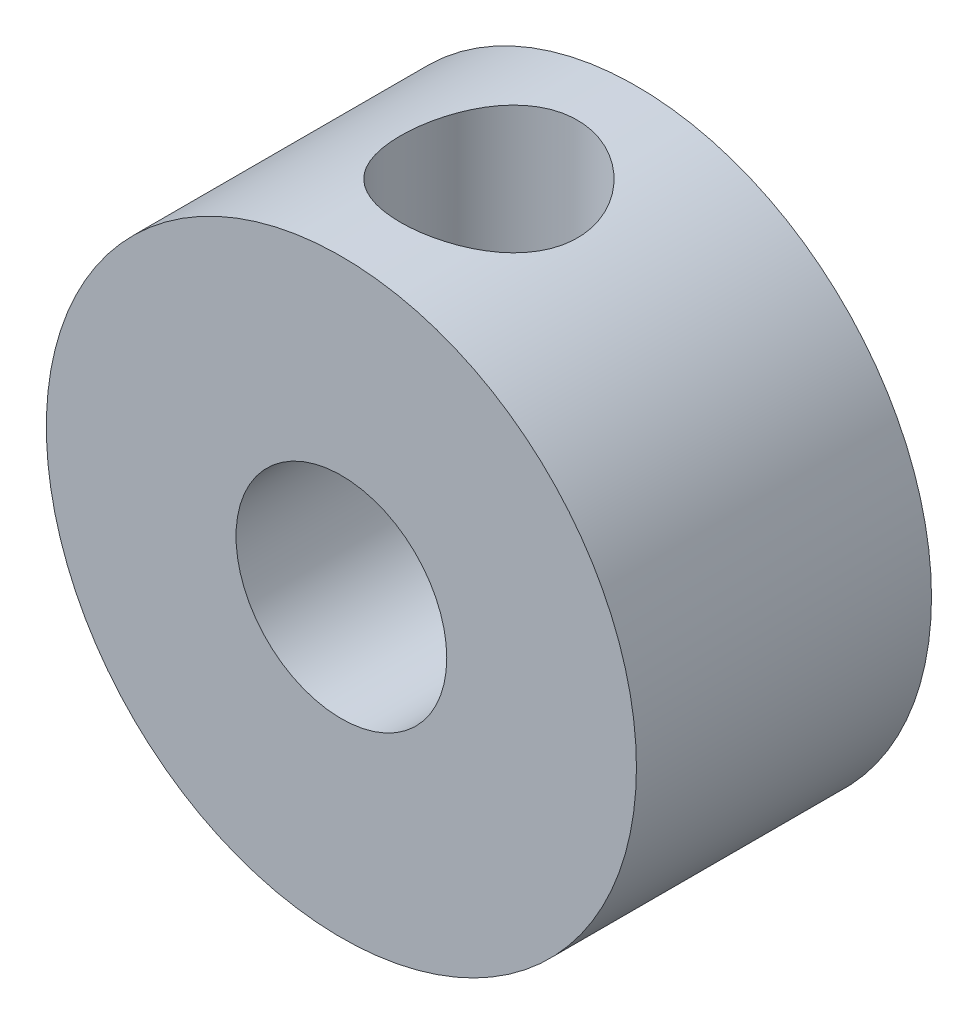
ISO-10303-21;
HEADER;
FILE_DESCRIPTION(('STEP AP214'),'2;1');
FILE_NAME('part.step','',(''),(''),'','','');
FILE_SCHEMA(('AUTOMOTIVE_DESIGN { 1 0 10303 214 1 1 1 1 }'));
ENDSEC;
DATA;
#1=APPLICATION_CONTEXT('core data for automotive mechanical design processes');
#2=APPLICATION_PROTOCOL_DEFINITION('international standard','automotive_design',2000,#1);
#3=PRODUCT_CONTEXT('',#1,'mechanical');
#4=PRODUCT('Part','Part','',(#3));
#5=PRODUCT_RELATED_PRODUCT_CATEGORY('part','',(#4));
#6=PRODUCT_DEFINITION_FORMATION('','',#4);
#7=PRODUCT_DEFINITION_CONTEXT('part definition',#1,'design');
#8=PRODUCT_DEFINITION('design','',#6,#7);
#9=PRODUCT_DEFINITION_SHAPE('','',#8);
#10=(LENGTH_UNIT() NAMED_UNIT(*) SI_UNIT(.MILLI.,.METRE.));
#11=(NAMED_UNIT(*) PLANE_ANGLE_UNIT() SI_UNIT($,.RADIAN.));
#12=(NAMED_UNIT(*) SI_UNIT($,.STERADIAN.) SOLID_ANGLE_UNIT());
#13=UNCERTAINTY_MEASURE_WITH_UNIT(LENGTH_MEASURE(1.E-05),#10,'distance_accuracy_value','');
#14=(GEOMETRIC_REPRESENTATION_CONTEXT(3) GLOBAL_UNCERTAINTY_ASSIGNED_CONTEXT((#13)) GLOBAL_UNIT_ASSIGNED_CONTEXT((#10,
#11,#12)) REPRESENTATION_CONTEXT('',''));
#15=CARTESIAN_POINT('',(0.,0.,0.));
#16=DIRECTION('',(0.,0.,1.));
#17=DIRECTION('',(1.,0.,0.));
#18=AXIS2_PLACEMENT_3D('',#15,#16,#17);
#19=CARTESIAN_POINT('',(0.,0.,7.));
#20=DIRECTION('',(0.,0.,1.));
#21=DIRECTION('',(1.,0.,0.));
#22=AXIS2_PLACEMENT_3D('',#19,#20,#21);
#23=PLANE('',#22);
#24=CARTESIAN_POINT('',(0.,0.,7.));
#25=DIRECTION('',(0.,0.,1.));
#26=DIRECTION('',(1.,0.,0.));
#27=AXIS2_PLACEMENT_3D('',#24,#25,#26);
#28=CIRCLE('',#27,7.);
#29=CARTESIAN_POINT('',(7.,0.,7.));
#30=VERTEX_POINT('',#29);
#31=EDGE_CURVE('E10',#30,#30,#28,.T.);
#32=ORIENTED_EDGE('',*,*,#31,.T.);
#33=EDGE_LOOP('',(#32));
#34=FACE_BOUND('',#33,.T.);
#35=CARTESIAN_POINT('',(0.,0.,7.));
#36=DIRECTION('',(0.,0.,1.));
#37=DIRECTION('',(1.,0.,0.));
#38=AXIS2_PLACEMENT_3D('',#35,#36,#37);
#39=CIRCLE('',#38,2.5);
#40=CARTESIAN_POINT('',(2.5,0.,7.));
#41=VERTEX_POINT('',#40);
#42=EDGE_CURVE('E47',#41,#41,#39,.T.);
#43=ORIENTED_EDGE('',*,*,#42,.F.);
#44=EDGE_LOOP('',(#43));
#45=FACE_BOUND('',#44,.T.);
#46=ADVANCED_FACE('F35',(#34,#45),#23,.T.);
#47=CARTESIAN_POINT('',(0.,0.,0.));
#48=DIRECTION('',(0.,0.,1.));
#49=DIRECTION('',(1.,0.,0.));
#50=AXIS2_PLACEMENT_3D('',#47,#48,#49);
#51=PLANE('',#50);
#52=CARTESIAN_POINT('',(0.,0.,0.));
#53=DIRECTION('',(0.,0.,1.));
#54=DIRECTION('',(1.,0.,0.));
#55=AXIS2_PLACEMENT_3D('',#52,#53,#54);
#56=CIRCLE('',#55,7.);
#57=CARTESIAN_POINT('',(7.,0.,0.));
#58=VERTEX_POINT('',#57);
#59=EDGE_CURVE('E40',#58,#58,#56,.T.);
#60=ORIENTED_EDGE('',*,*,#59,.F.);
#61=EDGE_LOOP('',(#60));
#62=FACE_BOUND('',#61,.T.);
#63=CARTESIAN_POINT('',(0.,0.,0.));
#64=DIRECTION('',(0.,0.,1.));
#65=DIRECTION('',(1.,0.,0.));
#66=AXIS2_PLACEMENT_3D('',#63,#64,#65);
#67=CIRCLE('',#66,2.5);
#68=CARTESIAN_POINT('',(2.5,0.,0.));
#69=VERTEX_POINT('',#68);
#70=EDGE_CURVE('E49',#69,#69,#67,.T.);
#71=ORIENTED_EDGE('',*,*,#70,.T.);
#72=EDGE_LOOP('',(#71));
#73=FACE_BOUND('',#72,.T.);
#74=ADVANCED_FACE('F76',(#62,#73),#51,.F.);
#75=CARTESIAN_POINT('',(0.,0.,7.));
#76=DIRECTION('',(0.,0.,-1.));
#77=DIRECTION('',(-1.,0.,0.));
#78=AXIS2_PLACEMENT_3D('',#75,#76,#77);
#79=CYLINDRICAL_SURFACE('',#78,7.);
#80=CARTESIAN_POINT('',(0.,7.,5.59999999999999));
#81=CARTESIAN_POINT('',(-0.115204057854619,6.9999990095077,5.59999860352115));
#82=CARTESIAN_POINT('',(-0.23042224569214,6.99712881971535,5.59048859092644));
#83=CARTESIAN_POINT('',(-0.457503375426832,6.98595947831167,5.55279010408905));
#84=CARTESIAN_POINT('',(-0.569365306175986,6.97765870745569,5.52459605876731));
#85=CARTESIAN_POINT('',(-0.786425790856335,6.95653773502571,5.45055557632562));
#86=CARTESIAN_POINT('',(-0.89163391015352,6.94372420350596,5.40473518253348));
#87=CARTESIAN_POINT('',(-1.09287385347438,6.91490952932704,5.29684946972182));
#88=CARTESIAN_POINT('',(-1.18890445445753,6.89890796268893,5.23478198964641));
#89=CARTESIAN_POINT('',(-1.37182051605724,6.86491032069884,5.09428638953826));
#90=CARTESIAN_POINT('',(-1.45840529974207,6.84687337119851,5.01547672375972));
#91=CARTESIAN_POINT('',(-1.61734889292653,6.81108167894619,4.84454707812574));
#92=CARTESIAN_POINT('',(-1.68970530858417,6.79332698414302,4.75242486302505));
#93=CARTESIAN_POINT('',(-1.8197205281319,6.75967759591281,4.55494094574734));
#94=CARTESIAN_POINT('',(-1.87701232631098,6.74383369329425,4.44932815461296));
#95=CARTESIAN_POINT('',(-1.97289952684664,6.71641068551644,4.22941504407759));
#96=CARTESIAN_POINT('',(-2.01149941887962,6.70483055638635,4.11511681850083));
#97=CARTESIAN_POINT('',(-2.06782287155712,6.68767219173808,3.88445362741736));
#98=CARTESIAN_POINT('',(-2.08610074728548,6.68193497054347,3.76823615859048));
#99=CARTESIAN_POINT('',(-2.1029922286054,6.67663905649674,3.53425358129653));
#100=CARTESIAN_POINT('',(-2.10161059865509,6.677078866648,3.41648885471728));
#101=CARTESIAN_POINT('',(-2.07965768079736,6.68394641694889,3.18726252794812));
#102=CARTESIAN_POINT('',(-2.05978087367759,6.69015744038797,3.07572684949287));
#103=CARTESIAN_POINT('',(-2.00252388597878,6.70751698720074,2.85765229921716));
#104=CARTESIAN_POINT('',(-1.96514197798297,6.71866599785291,2.75111392167594));
#105=CARTESIAN_POINT('',(-1.87342437315154,6.74481826304963,2.54435951047497));
#106=CARTESIAN_POINT('',(-1.81886343708499,6.75987222562333,2.44425008246264));
#107=CARTESIAN_POINT('',(-1.69449311624156,6.7921138180009,2.25437516918573));
#108=CARTESIAN_POINT('',(-1.62468003603623,6.80930196445788,2.16461219882071));
#109=CARTESIAN_POINT('',(-1.46833807071764,6.84475415817112,1.99403933293317));
#110=CARTESIAN_POINT('',(-1.38123287045376,6.86303316034697,1.91375987035847));
#111=CARTESIAN_POINT('',(-1.19456856303955,6.89797141688562,1.76882442231006));
#112=CARTESIAN_POINT('',(-1.09500867260524,6.91463056925774,1.70416942021981));
#113=CARTESIAN_POINT('',(-0.885297053679921,6.94460424097259,1.59199610854938));
#114=CARTESIAN_POINT('',(-0.775078849647127,6.9578956113564,1.5445954772502));
#115=CARTESIAN_POINT('',(-0.547743581844925,6.97946930565111,1.46916057386052));
#116=CARTESIAN_POINT('',(-0.430628452225412,6.98775302661799,1.44112090005452));
#117=CARTESIAN_POINT('',(-0.197333139735663,6.99815710500954,1.40608695094086));
#118=CARTESIAN_POINT('',(-0.0812701366416606,7.00048790584906,1.39837377987775));
#119=CARTESIAN_POINT('',(0.150499448152737,6.99934092538464,1.40219681799692));
#120=CARTESIAN_POINT('',(0.266206075367093,6.9958639194886,1.41373045751203));
#121=CARTESIAN_POINT('',(0.491265047433575,6.98362975782027,1.4551384555561));
#122=CARTESIAN_POINT('',(0.600701881659836,6.9749936171918,1.48459274261322));
#123=CARTESIAN_POINT('',(0.813056494536329,6.95344086978149,1.56050052588949));
#124=CARTESIAN_POINT('',(0.915973487835815,6.94052374849531,1.60695606545301));
#125=CARTESIAN_POINT('',(1.11501206524547,6.91137516091842,1.71675443167359));
#126=CARTESIAN_POINT('',(1.21092135667953,6.89507393161496,1.78046307732718));
#127=CARTESIAN_POINT('',(1.3909326311722,6.86102856270093,1.92251465567393));
#128=CARTESIAN_POINT('',(1.47503164529831,6.84328406203694,2.00086125664271));
#129=CARTESIAN_POINT('',(1.63220042371436,6.80754440616605,2.17334223171712));
#130=CARTESIAN_POINT('',(1.704758737241,6.78956355045859,2.26794662608056));
#131=CARTESIAN_POINT('',(1.83300593101018,6.75607121334564,2.46837911461882));
#132=CARTESIAN_POINT('',(1.88869525361275,6.74055966719185,2.57420691438104));
#133=CARTESIAN_POINT('',(1.9812428597802,6.71394065458417,2.79374548775703));
#134=CARTESIAN_POINT('',(2.01818885711814,6.70281272971451,2.90741666115297));
#135=CARTESIAN_POINT('',(2.07230423141214,6.68628232117816,3.13976315650233));
#136=CARTESIAN_POINT('',(2.08948038570493,6.68087787548571,3.25843674909625));
#137=CARTESIAN_POINT('',(2.1031077827895,6.67659961459091,3.49210612574379));
#138=CARTESIAN_POINT('',(2.1003927743112,6.67746306290276,3.60704911146919));
#139=CARTESIAN_POINT('',(2.07630507622027,6.68499161674532,3.83475974476086));
#140=CARTESIAN_POINT('',(2.05493313374585,6.69165648995131,3.94752747925272));
#141=CARTESIAN_POINT('',(1.9946764432608,6.7098606917247,4.16632355878434));
#142=CARTESIAN_POINT('',(1.95601245709973,6.72133846373454,4.27241820230217));
#143=CARTESIAN_POINT('',(1.86244109969503,6.74786390463686,4.47669941434901));
#144=CARTESIAN_POINT('',(1.80753061948005,6.76291225669556,4.5748844646982));
#145=CARTESIAN_POINT('',(1.68068269327122,6.79556746998737,4.76442836313677));
#146=CARTESIAN_POINT('',(1.60819786530197,6.81324756230006,4.85540826576426));
#147=CARTESIAN_POINT('',(1.44924408481688,6.84881848629347,5.02418349763132));
#148=CARTESIAN_POINT('',(1.36277150398828,6.8667093715328,5.10197539525494));
#149=CARTESIAN_POINT('',(1.17525206705656,6.90131311199101,5.24443277721295));
#150=CARTESIAN_POINT('',(1.07385304010685,6.91797623671995,5.30864802559766));
#151=CARTESIAN_POINT('',(0.861197923576932,6.94764952638087,5.41902923786565));
#152=CARTESIAN_POINT('',(0.749946474198531,6.9606613990348,5.46520364358431));
#153=CARTESIAN_POINT('',(0.533060797717391,6.98043044957033,5.53405338591384));
#154=CARTESIAN_POINT('',(0.428101746735925,6.98770838333498,5.55871634203654));
#155=CARTESIAN_POINT('',(0.215432273323089,6.99749322292286,5.5916889353382));
#156=CARTESIAN_POINT('',(0.107722313801395,7.00000092616635,5.60000130578674));
#157=CARTESIAN_POINT('',(0.,7.,5.59999999999999));
#158=B_SPLINE_CURVE_WITH_KNOTS('',3,(#80,#81,#82,#83,#84,#85,#86,#87,#88,#89,#90,#91,#92,#93,
#94,#95,#96,#97,#98,#99,#100,#101,#102,#103,#104,#105,#106,#107,#108,#109,#110,#111,#112,#113,
#114,#115,#116,#117,#118,#119,#120,#121,#122,#123,#124,#125,#126,#127,#128,#129,#130,#131,#132,
#133,#134,#135,#136,#137,#138,#139,#140,#141,#142,#143,#144,#145,#146,#147,#148,#149,#150,#151,
#152,#153,#154,#155,#156,#157),.UNSPECIFIED.,.T.,.F.,(4,2,2,2,2,2,2,2,2,2,2,2,2,2,2,2,2,2,2,2,2,
2,2,2,2,2,2,2,2,2,2,2,2,2,2,2,2,2,4),(0.,0.345216485057654,0.690535950784397,1.03534714682122,
1.38020423017778,1.73397844127468,2.08781212204086,2.44960073405752,2.81130240360512,
3.16287565099237,3.51436369646724,3.85316423376745,4.191998211212,4.53547397025966,
4.87903304221976,5.23693945667431,5.59486839143498,5.95519465634362,6.31542034940329,
6.66272333213961,7.00997994970455,7.34939445355255,7.68884976431217,8.03615827984069,
8.38355394800265,8.74356560451943,9.1035678195375,9.46186940931749,9.82004813244393,
10.1633021765698,10.5065424753262,10.8455205657019,11.1845635658073,11.5359569595828,
11.8874416486288,12.2492019462572,12.6107927623971,12.9336436870902,13.256440637348),.UNSPECIFIED.);
#159=CARTESIAN_POINT('',(0.,7.,5.59999999999999));
#160=VERTEX_POINT('',#159);
#161=EDGE_CURVE('E52',#160,#160,#158,.T.);
#162=ORIENTED_EDGE('',*,*,#161,.T.);
#163=EDGE_LOOP('',(#162));
#164=FACE_BOUND('',#163,.T.);
#165=ORIENTED_EDGE('',*,*,#31,.F.);
#166=EDGE_LOOP('',(#165));
#167=FACE_BOUND('',#166,.T.);
#168=ORIENTED_EDGE('',*,*,#59,.T.);
#169=EDGE_LOOP('',(#168));
#170=FACE_BOUND('',#169,.T.);
#171=ADVANCED_FACE('F37',(#164,#167,#170),#79,.T.);
#172=CARTESIAN_POINT('',(0.,0.,7.));
#173=DIRECTION('',(0.,0.,-1.));
#174=DIRECTION('',(-1.,0.,0.));
#175=AXIS2_PLACEMENT_3D('',#172,#173,#174);
#176=CYLINDRICAL_SURFACE('',#175,2.5);
#177=CARTESIAN_POINT('',(0.,2.5,5.59999999999999));
#178=CARTESIAN_POINT('',(-0.0993730256022459,2.49999235681323,5.59999218206988));
#179=CARTESIAN_POINT('',(-0.198894461648654,2.49401423672587,5.59288501982625));
#180=CARTESIAN_POINT('',(-0.394712099458266,2.47062386361919,5.56495473817506));
#181=CARTESIAN_POINT('',(-0.49100041255824,2.45318551674386,5.54410031722224));
#182=CARTESIAN_POINT('',(-0.676934489714191,2.40849407320788,5.49024330228096));
#183=CARTESIAN_POINT('',(-0.766619643075995,2.38130603299301,5.45732120035383));
#184=CARTESIAN_POINT('',(-0.938364030346449,2.31901636821694,5.3810418197187));
#185=CARTESIAN_POINT('',(-1.02042318288168,2.28391465922644,5.33768442967843));
#186=CARTESIAN_POINT('',(-1.20508095932735,2.19360207513658,5.22437703447378));
#187=CARTESIAN_POINT('',(-1.30400396937414,2.13576228881416,5.15052906935894));
#188=CARTESIAN_POINT('',(-1.48564887479632,2.01367590232411,4.98919024514837));
#189=CARTESIAN_POINT('',(-1.56832369757732,1.94941147777541,4.90166102799466));
#190=CARTESIAN_POINT('',(-1.71877589361501,1.81821074291079,4.71271884439298));
#191=CARTESIAN_POINT('',(-1.78623999238275,1.75124686144345,4.61107346397337));
#192=CARTESIAN_POINT('',(-1.87423794813291,1.65503457960635,4.44919914297048));
#193=CARTESIAN_POINT('',(-1.90135639211036,1.6236900614713,4.39371583746389));
#194=CARTESIAN_POINT('',(-1.95101171748606,1.56366934291663,4.27938306823519));
#195=CARTESIAN_POINT('',(-1.97355246264258,1.53499090340244,4.22053649745956));
#196=CARTESIAN_POINT('',(-2.01536124409852,1.47973546664874,4.09422401073507));
#197=CARTESIAN_POINT('',(-2.0342028938972,1.45352993494711,4.02644799639922));
#198=CARTESIAN_POINT('',(-2.06527249369073,1.40903910635949,3.88695313475466));
#199=CARTESIAN_POINT('',(-2.07751605234462,1.39073513788833,3.81524403881115));
#200=CARTESIAN_POINT('',(-2.09459755052995,1.36488977022329,3.66794159064057));
#201=CARTESIAN_POINT('',(-2.09933757951667,1.35749074972234,3.59230997503386));
#202=CARTESIAN_POINT('',(-2.10053165369518,1.35564367802451,3.44083251890798));
#203=CARTESIAN_POINT('',(-2.09698775837108,1.36119240785915,3.3649867363157));
#204=CARTESIAN_POINT('',(-2.08157225094924,1.38464712394947,3.21114717025583));
#205=CARTESIAN_POINT('',(-2.06917552359479,1.4033310938042,3.13333302758938));
#206=CARTESIAN_POINT('',(-2.03663853769777,1.45013886604577,2.9821947440325));
#207=CARTESIAN_POINT('',(-2.01647195943918,1.47829471204012,2.90888685718313));
#208=CARTESIAN_POINT('',(-1.97403882515764,1.53432551020143,2.78113609171079));
#209=CARTESIAN_POINT('',(-1.95296589301681,1.5611660216066,2.7258191070541));
#210=CARTESIAN_POINT('',(-1.90677427610891,1.61726218100521,2.61815981019017));
#211=CARTESIAN_POINT('',(-1.88165311554881,1.64651930156359,2.56581934501765));
#212=CARTESIAN_POINT('',(-1.80045722057009,1.73632877202852,2.41293641434154));
#213=CARTESIAN_POINT('',(-1.73857376837966,1.79888580247094,2.31660176408119));
#214=CARTESIAN_POINT('',(-1.59579178548322,1.92697550014964,2.12956765322733));
#215=CARTESIAN_POINT('',(-1.51398796192494,1.99246641213293,2.03953429800796));
#216=CARTESIAN_POINT('',(-1.33362147394089,2.11741444234028,1.87321437911365));
#217=CARTESIAN_POINT('',(-1.2350931957034,2.17688354894805,1.79690025805045));
#218=CARTESIAN_POINT('',(-1.04606866583771,2.2725026109996,1.67646752478603));
#219=CARTESIAN_POINT('',(-0.958857259834114,2.31087848129323,1.62897504601198));
#220=CARTESIAN_POINT('',(-0.775629660941279,2.37863696788947,1.54590336836828));
#221=CARTESIAN_POINT('',(-0.679618471130901,2.40802465366704,1.51031745294468));
#222=CARTESIAN_POINT('',(-0.47993897191399,2.45565985501553,1.45292307672678));
#223=CARTESIAN_POINT('',(-0.376214464265043,2.47381430175865,1.43122966679031));
#224=CARTESIAN_POINT('',(-0.165239035352773,2.4967820572008,1.40381797362978));
#225=CARTESIAN_POINT('',(-0.0579910743036057,2.50160628914294,1.3980866105171));
#226=CARTESIAN_POINT('',(0.141982570703245,2.4977064284626,1.40273147820422));
#227=CARTESIAN_POINT('',(0.234797260987624,2.490649465896,1.4111255899601));
#228=CARTESIAN_POINT('',(0.417235152283134,2.46665360458315,1.43979574937018));
#229=CARTESIAN_POINT('',(0.506858080344462,2.4497138628345,1.46007281064224));
#230=CARTESIAN_POINT('',(0.680859199372369,2.40717070379505,1.51136321519745));
#231=CARTESIAN_POINT('',(0.765231733507005,2.3815581272642,1.5423879096834));
#232=CARTESIAN_POINT('',(0.927287359991375,2.32326696301429,1.6137365553774));
#233=CARTESIAN_POINT('',(1.00496777424084,2.29058556464245,1.65406420598376));
#234=CARTESIAN_POINT('',(1.18582278648896,2.20405034491775,1.7623755404598));
#235=CARTESIAN_POINT('',(1.28500120331796,2.14723900759011,1.83468809764071));
#236=CARTESIAN_POINT('',(1.4674111707023,2.02699462521279,1.9928953964666));
#237=CARTESIAN_POINT('',(1.55059698027561,1.96354336556242,2.07882785053658));
#238=CARTESIAN_POINT('',(1.7022867931299,1.83365930236986,2.26434086820865));
#239=CARTESIAN_POINT('',(1.77049341616494,1.76719315448969,2.36414291471131));
#240=CARTESIAN_POINT('',(1.85989841024775,1.6711398567174,2.5230407433287));
#241=CARTESIAN_POINT('',(1.88753704511958,1.63974677213346,2.57750514742023));
#242=CARTESIAN_POINT('',(1.93835723718053,1.57934206807542,2.68971300222851));
#243=CARTESIAN_POINT('',(1.96154209274454,1.55032869543311,2.74745398500656));
#244=CARTESIAN_POINT('',(2.00546732844908,1.49316445828113,2.87309476195081));
#245=CARTESIAN_POINT('',(2.02564470128842,1.46547259201834,2.94140862100766));
#246=CARTESIAN_POINT('',(2.05928882593353,1.41780992180363,3.08221125500124));
#247=CARTESIAN_POINT('',(2.07277001860966,1.39782252357173,3.15469066635017));
#248=CARTESIAN_POINT('',(2.09220045313067,1.36858699102638,3.30399486340788));
#249=CARTESIAN_POINT('',(2.09804139433367,1.35949342538339,3.38086634012621));
#250=CARTESIAN_POINT('',(2.10111949924829,1.35473717985817,3.53518243647304));
#251=CARTESIAN_POINT('',(2.09836281059348,1.35906490322945,3.61262660709167));
#252=CARTESIAN_POINT('',(2.08565152579525,1.37845870531478,3.75362800434727));
#253=CARTESIAN_POINT('',(2.07682414703654,1.39183839640925,3.81754241715057));
#254=CARTESIAN_POINT('',(2.05382763816653,1.42555682918549,3.94253378956344));
#255=CARTESIAN_POINT('',(2.03965016544351,1.44590643472727,4.00360614950802));
#256=CARTESIAN_POINT('',(1.99332588452214,1.50969345143494,4.17009294266176));
#257=CARTESIAN_POINT('',(1.95587568242063,1.5585803900557,4.27191180695538));
#258=CARTESIAN_POINT('',(1.86775331734825,1.66319886386284,4.46586305160102));
#259=CARTESIAN_POINT('',(1.81704180517593,1.71895050312424,4.55796543999198));
#260=CARTESIAN_POINT('',(1.69917403585594,1.83580085816793,4.73904881524718));
#261=CARTESIAN_POINT('',(1.63113117269078,1.89700470554673,4.82738697349876));
#262=CARTESIAN_POINT('',(1.48087039537914,2.0164906922685,4.99315309908594));
#263=CARTESIAN_POINT('',(1.39867179886944,2.0747766753739,5.07059567677441));
#264=CARTESIAN_POINT('',(1.22871778675751,2.17927144644785,5.20613252193997));
#265=CARTESIAN_POINT('',(1.14226966651485,2.22610312268135,5.26537388274854));
#266=CARTESIAN_POINT('',(0.958257418317773,2.3112734329689,5.37162845538846));
#267=CARTESIAN_POINT('',(0.860700171208671,2.34961728140331,5.4186491779097));
#268=CARTESIAN_POINT('',(0.672523474698148,2.40953347022022,5.49153373036494));
#269=CARTESIAN_POINT('',(0.58329437259825,2.43280819164694,5.5195796687695));
#270=CARTESIAN_POINT('',(0.400084141601266,2.46953481506509,5.56367478541061));
#271=CARTESIAN_POINT('',(0.306115806920453,2.48301179337184,5.57975459224184));
#272=CARTESIAN_POINT('',(0.176152977211488,2.49403576514249,5.59289668571569));
#273=CARTESIAN_POINT('',(0.141020741943709,2.49626804937888,5.59555605749173));
#274=CARTESIAN_POINT('',(0.070598602855718,2.49925166865652,5.59910927519441));
#275=CARTESIAN_POINT('',(0.0353086697141505,2.50000271573453,5.60000277782336));
#276=CARTESIAN_POINT('',(0.,2.5,5.59999999999999));
#277=B_SPLINE_CURVE_WITH_KNOTS('',3,(#177,#178,#179,#180,#181,#182,#183,#184,#185,#186,#187,
#188,#189,#190,#191,#192,#193,#194,#195,#196,#197,#198,#199,#200,#201,#202,#203,#204,#205,#206,
#207,#208,#209,#210,#211,#212,#213,#214,#215,#216,#217,#218,#219,#220,#221,#222,#223,#224,#225,
#226,#227,#228,#229,#230,#231,#232,#233,#234,#235,#236,#237,#238,#239,#240,#241,#242,#243,#244,
#245,#246,#247,#248,#249,#250,#251,#252,#253,#254,#255,#256,#257,#258,#259,#260,#261,#262,#263,
#264,#265,#266,#267,#268,#269,#270,#271,#272,#273,#274,#275,#276),.UNSPECIFIED.,.T.,.F.,(4,2,2,
2,2,2,2,2,2,2,2,2,2,2,2,2,2,2,2,2,2,2,2,2,2,2,2,2,2,2,2,2,2,2,2,2,2,2,2,2,2,2,2,2,2,2,2,2,2,4),
(0.,0.297962620674466,0.596606035663122,0.893292691432594,1.18998251264047,1.59675200685625,
2.0046831212529,2.42037345900015,2.62792558018692,2.83530178438656,3.05987449559392,
3.28391359186868,3.51085267450523,3.73773534333244,3.97933039459959,4.22175112797396,
4.41648056644972,4.61132955161957,5.00126650512848,5.4141704598235,5.8262355276747,
6.14441396184944,6.46241260611802,6.78301181803361,7.10334824175016,7.38236969632224,
7.6614149549425,7.94075583262646,8.22020798461903,8.62374969606757,9.02842895783349,
9.4405331385982,9.64634836985897,9.85201058606808,10.0806637317801,10.3088216034389,
10.5401797720754,10.7713725487261,10.9683042381135,11.1655442883211,11.5205132267229,
11.8765476282863,12.2568989386322,12.6367352566501,12.9798180218012,13.3226894301976,
13.610660066359,13.8978910513837,14.0037408934564,14.1096113114777),.UNSPECIFIED.);
#278=CARTESIAN_POINT('',(0.,2.5,5.59999999999999));
#279=VERTEX_POINT('',#278);
#280=EDGE_CURVE('E60',#279,#279,#277,.T.);
#281=ORIENTED_EDGE('',*,*,#280,.F.);
#282=EDGE_LOOP('',(#281));
#283=FACE_BOUND('',#282,.T.);
#284=ORIENTED_EDGE('',*,*,#42,.T.);
#285=EDGE_LOOP('',(#284));
#286=FACE_BOUND('',#285,.T.);
#287=ORIENTED_EDGE('',*,*,#70,.F.);
#288=EDGE_LOOP('',(#287));
#289=FACE_BOUND('',#288,.T.);
#290=ADVANCED_FACE('F67',(#283,#286,#289),#176,.F.);
#291=CARTESIAN_POINT('',(0.,7.,3.5));
#292=DIRECTION('',(0.,1.,0.));
#293=DIRECTION('',(0.,0.,1.));
#294=AXIS2_PLACEMENT_3D('',#291,#292,#293);
#295=CYLINDRICAL_SURFACE('',#294,2.09999999999999);
#296=ORIENTED_EDGE('',*,*,#280,.T.);
#297=EDGE_LOOP('',(#296));
#298=FACE_BOUND('',#297,.T.);
#299=ORIENTED_EDGE('',*,*,#161,.F.);
#300=EDGE_LOOP('',(#299));
#301=FACE_BOUND('',#300,.T.);
#302=ADVANCED_FACE('F64',(#298,#301),#295,.F.);
#303=CLOSED_SHELL('',(#46,#74,#171,#290,#302));
#304=MANIFOLD_SOLID_BREP('B2',#303);
#305=ADVANCED_BREP_SHAPE_REPRESENTATION('',(#18,#304),#14);
#306=SHAPE_DEFINITION_REPRESENTATION(#9,#305);
ENDSEC;
END-ISO-10303-21;
